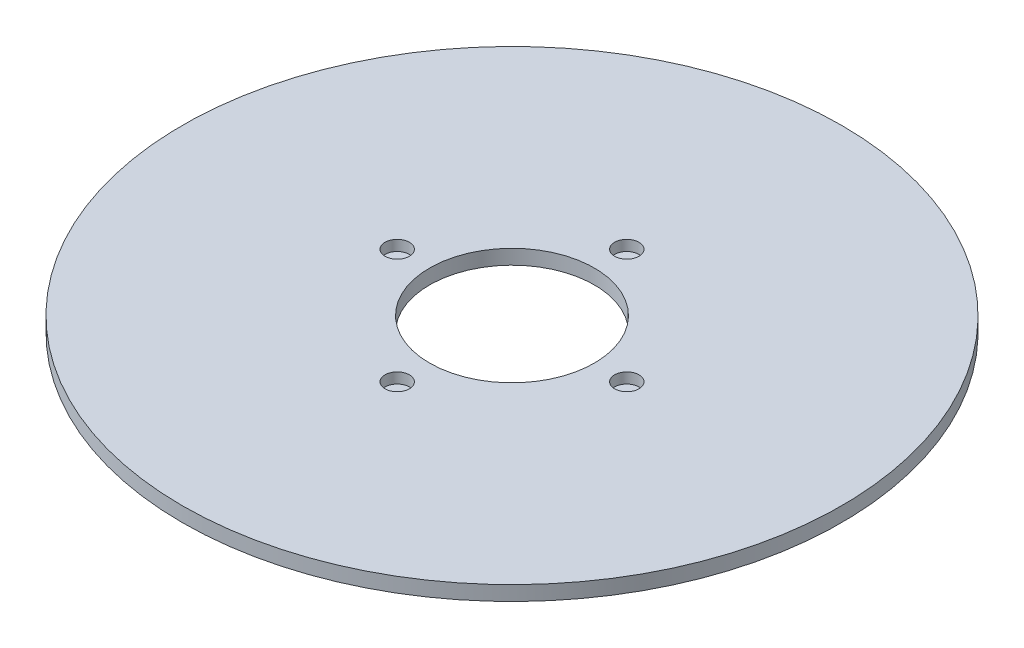
ISO-10303-21;
HEADER;
FILE_DESCRIPTION(('STEP AP214'),'2;1');
FILE_NAME('part.step','',(''),(''),'','','');
FILE_SCHEMA(('AUTOMOTIVE_DESIGN { 1 0 10303 214 1 1 1 1 }'));
ENDSEC;
DATA;
#1=APPLICATION_CONTEXT('core data for automotive mechanical design processes');
#2=APPLICATION_PROTOCOL_DEFINITION('international standard','automotive_design',2000,#1);
#3=PRODUCT_CONTEXT('',#1,'mechanical');
#4=PRODUCT('Part','Part','',(#3));
#5=PRODUCT_RELATED_PRODUCT_CATEGORY('part','',(#4));
#6=PRODUCT_DEFINITION_FORMATION('','',#4);
#7=PRODUCT_DEFINITION_CONTEXT('part definition',#1,'design');
#8=PRODUCT_DEFINITION('design','',#6,#7);
#9=PRODUCT_DEFINITION_SHAPE('','',#8);
#10=(LENGTH_UNIT() NAMED_UNIT(*) SI_UNIT(.MILLI.,.METRE.));
#11=(NAMED_UNIT(*) PLANE_ANGLE_UNIT() SI_UNIT($,.RADIAN.));
#12=(NAMED_UNIT(*) SI_UNIT($,.STERADIAN.) SOLID_ANGLE_UNIT());
#13=UNCERTAINTY_MEASURE_WITH_UNIT(LENGTH_MEASURE(1.E-05),#10,'distance_accuracy_value','');
#14=(GEOMETRIC_REPRESENTATION_CONTEXT(3) GLOBAL_UNCERTAINTY_ASSIGNED_CONTEXT((#13)) GLOBAL_UNIT_ASSIGNED_CONTEXT((#10,
#11,#12)) REPRESENTATION_CONTEXT('',''));
#15=CARTESIAN_POINT('',(0.,0.,0.));
#16=DIRECTION('',(0.,0.,1.));
#17=DIRECTION('',(1.,0.,0.));
#18=AXIS2_PLACEMENT_3D('',#15,#16,#17);
#19=CARTESIAN_POINT('',(0.,4.,0.));
#20=DIRECTION('',(0.,-1.,0.));
#21=DIRECTION('',(0.,0.,-1.));
#22=AXIS2_PLACEMENT_3D('',#19,#20,#21);
#23=CYLINDRICAL_SURFACE('',#22,90.);
#24=CARTESIAN_POINT('',(0.,4.,0.));
#25=DIRECTION('',(0.,1.,0.));
#26=DIRECTION('',(0.,0.,1.));
#27=AXIS2_PLACEMENT_3D('',#24,#25,#26);
#28=CIRCLE('',#27,90.);
#29=CARTESIAN_POINT('',(0.,4.,90.));
#30=VERTEX_POINT('',#29);
#31=EDGE_CURVE('E10',#30,#30,#28,.T.);
#32=ORIENTED_EDGE('',*,*,#31,.F.);
#33=EDGE_LOOP('',(#32));
#34=FACE_BOUND('',#33,.T.);
#35=CARTESIAN_POINT('',(0.,0.,0.));
#36=DIRECTION('',(0.,1.,0.));
#37=DIRECTION('',(0.,0.,1.));
#38=AXIS2_PLACEMENT_3D('',#35,#36,#37);
#39=CIRCLE('',#38,90.);
#40=CARTESIAN_POINT('',(0.,0.,90.));
#41=VERTEX_POINT('',#40);
#42=EDGE_CURVE('E37',#41,#41,#39,.T.);
#43=ORIENTED_EDGE('',*,*,#42,.T.);
#44=EDGE_LOOP('',(#43));
#45=FACE_BOUND('',#44,.T.);
#46=ADVANCED_FACE('F40',(#34,#45),#23,.T.);
#47=CARTESIAN_POINT('',(0.,4.,0.));
#48=DIRECTION('',(0.,1.,0.));
#49=DIRECTION('',(0.,0.,1.));
#50=AXIS2_PLACEMENT_3D('',#47,#48,#49);
#51=PLANE('',#50);
#52=CARTESIAN_POINT('',(1.09455664035941E-13,4.,31.3493481457953));
#53=DIRECTION('',(0.,1.,0.));
#54=DIRECTION('',(1.,0.,0.));
#55=AXIS2_PLACEMENT_3D('',#52,#53,#54);
#56=CIRCLE('',#55,3.32239042248186);
#57=CARTESIAN_POINT('',(3.32239042248197,4.,31.3493481457953));
#58=VERTEX_POINT('',#57);
#59=EDGE_CURVE('E71',#58,#58,#56,.T.);
#60=ORIENTED_EDGE('',*,*,#59,.F.);
#61=EDGE_LOOP('',(#60));
#62=FACE_BOUND('',#61,.T.);
#63=CARTESIAN_POINT('',(31.3493481457953,4.,0.));
#64=DIRECTION('',(0.,1.,0.));
#65=DIRECTION('',(0.,0.,-1.));
#66=AXIS2_PLACEMENT_3D('',#63,#64,#65);
#67=CIRCLE('',#66,3.32239042248186);
#68=CARTESIAN_POINT('',(31.3493481457953,4.,-3.32239042248186));
#69=VERTEX_POINT('',#68);
#70=EDGE_CURVE('E70',#69,#69,#67,.T.);
#71=ORIENTED_EDGE('',*,*,#70,.F.);
#72=EDGE_LOOP('',(#71));
#73=FACE_BOUND('',#72,.T.);
#74=CARTESIAN_POINT('',(-3.28366992107823E-13,4.,-31.3493481457953));
#75=DIRECTION('',(0.,1.,0.));
#76=DIRECTION('',(-1.,0.,0.));
#77=AXIS2_PLACEMENT_3D('',#74,#75,#76);
#78=CIRCLE('',#77,3.32239042248186);
#79=CARTESIAN_POINT('',(-3.32239042248219,4.,-31.3493481457953));
#80=VERTEX_POINT('',#79);
#81=EDGE_CURVE('E61',#80,#80,#78,.T.);
#82=ORIENTED_EDGE('',*,*,#81,.F.);
#83=EDGE_LOOP('',(#82));
#84=FACE_BOUND('',#83,.T.);
#85=CARTESIAN_POINT('',(-31.3493481457953,4.,0.));
#86=DIRECTION('',(0.,1.,0.));
#87=DIRECTION('',(0.,0.,1.));
#88=AXIS2_PLACEMENT_3D('',#85,#86,#87);
#89=CIRCLE('',#88,3.32239042248186);
#90=CARTESIAN_POINT('',(-31.3493481457953,4.,3.32239042248186));
#91=VERTEX_POINT('',#90);
#92=EDGE_CURVE('E54',#91,#91,#89,.T.);
#93=ORIENTED_EDGE('',*,*,#92,.F.);
#94=EDGE_LOOP('',(#93));
#95=FACE_BOUND('',#94,.T.);
#96=CARTESIAN_POINT('',(0.,4.,0.));
#97=DIRECTION('',(0.,1.,0.));
#98=DIRECTION('',(0.,0.,1.));
#99=AXIS2_PLACEMENT_3D('',#96,#97,#98);
#100=CIRCLE('',#99,22.5);
#101=CARTESIAN_POINT('',(0.,4.,22.5));
#102=VERTEX_POINT('',#101);
#103=EDGE_CURVE('E50',#102,#102,#100,.T.);
#104=ORIENTED_EDGE('',*,*,#103,.F.);
#105=EDGE_LOOP('',(#104));
#106=FACE_BOUND('',#105,.T.);
#107=ORIENTED_EDGE('',*,*,#31,.T.);
#108=EDGE_LOOP('',(#107));
#109=FACE_BOUND('',#108,.T.);
#110=ADVANCED_FACE('F86',(#62,#73,#84,#95,#106,#109),#51,.T.);
#111=CARTESIAN_POINT('',(0.,0.,0.));
#112=DIRECTION('',(0.,1.,0.));
#113=DIRECTION('',(0.,0.,1.));
#114=AXIS2_PLACEMENT_3D('',#111,#112,#113);
#115=PLANE('',#114);
#116=CARTESIAN_POINT('',(0.,0.,0.));
#117=DIRECTION('',(0.,1.,0.));
#118=DIRECTION('',(0.,0.,1.));
#119=AXIS2_PLACEMENT_3D('',#116,#117,#118);
#120=CIRCLE('',#119,22.5);
#121=CARTESIAN_POINT('',(0.,0.,22.5));
#122=VERTEX_POINT('',#121);
#123=EDGE_CURVE('E47',#122,#122,#120,.T.);
#124=ORIENTED_EDGE('',*,*,#123,.T.);
#125=EDGE_LOOP('',(#124));
#126=FACE_BOUND('',#125,.T.);
#127=ORIENTED_EDGE('',*,*,#42,.F.);
#128=EDGE_LOOP('',(#127));
#129=FACE_BOUND('',#128,.T.);
#130=ADVANCED_FACE('F93',(#126,#129),#115,.F.);
#131=CARTESIAN_POINT('',(0.,4.,0.));
#132=DIRECTION('',(0.,-1.,0.));
#133=DIRECTION('',(0.,0.,-1.));
#134=AXIS2_PLACEMENT_3D('',#131,#132,#133);
#135=CYLINDRICAL_SURFACE('',#134,22.5);
#136=ORIENTED_EDGE('',*,*,#103,.T.);
#137=EDGE_LOOP('',(#136));
#138=FACE_BOUND('',#137,.T.);
#139=ORIENTED_EDGE('',*,*,#123,.F.);
#140=EDGE_LOOP('',(#139));
#141=FACE_BOUND('',#140,.T.);
#142=ADVANCED_FACE('F101',(#138,#141),#135,.F.);
#143=CARTESIAN_POINT('',(-31.3493481457953,1.12181379695333,0.));
#144=DIRECTION('',(0.,1.,0.));
#145=DIRECTION('',(0.,0.,1.));
#146=AXIS2_PLACEMENT_3D('',#143,#144,#145);
#147=CYLINDRICAL_SURFACE('',#146,3.32239042248186);
#148=CARTESIAN_POINT('',(-31.3493481457953,1.12181379695333,0.));
#149=DIRECTION('',(0.,1.,0.));
#150=DIRECTION('',(0.,0.,1.));
#151=AXIS2_PLACEMENT_3D('',#148,#149,#150);
#152=CIRCLE('',#151,3.32239042248186);
#153=CARTESIAN_POINT('',(-31.3493481457953,1.12181379695333,3.32239042248186));
#154=VERTEX_POINT('',#153);
#155=EDGE_CURVE('E55',#154,#154,#152,.T.);
#156=ORIENTED_EDGE('',*,*,#155,.F.);
#157=EDGE_LOOP('',(#156));
#158=FACE_BOUND('',#157,.T.);
#159=ORIENTED_EDGE('',*,*,#92,.T.);
#160=EDGE_LOOP('',(#159));
#161=FACE_BOUND('',#160,.T.);
#162=ADVANCED_FACE('F102',(#158,#161),#147,.F.);
#163=CARTESIAN_POINT('',(-31.3493481457953,1.12181379695333,0.));
#164=DIRECTION('',(0.,1.,0.));
#165=DIRECTION('',(0.,0.,1.));
#166=AXIS2_PLACEMENT_3D('',#163,#164,#165);
#167=PLANE('',#166);
#168=ORIENTED_EDGE('',*,*,#155,.T.);
#169=EDGE_LOOP('',(#168));
#170=FACE_BOUND('',#169,.T.);
#171=ADVANCED_FACE('F133',(#170),#167,.T.);
#172=CARTESIAN_POINT('',(-3.28366992107823E-13,1.12181379695333,-31.3493481457953));
#173=DIRECTION('',(0.,1.,0.));
#174=DIRECTION('',(0.,0.,1.));
#175=AXIS2_PLACEMENT_3D('',#172,#173,#174);
#176=CYLINDRICAL_SURFACE('',#175,3.32239042248186);
#177=CARTESIAN_POINT('',(-3.28366992107823E-13,1.12181379695333,-31.3493481457953));
#178=DIRECTION('',(0.,1.,0.));
#179=DIRECTION('',(-1.,0.,0.));
#180=AXIS2_PLACEMENT_3D('',#177,#178,#179);
#181=CIRCLE('',#180,3.32239042248186);
#182=CARTESIAN_POINT('',(-3.32239042248219,1.12181379695333,-31.3493481457953));
#183=VERTEX_POINT('',#182);
#184=EDGE_CURVE('E63',#183,#183,#181,.T.);
#185=ORIENTED_EDGE('',*,*,#184,.F.);
#186=EDGE_LOOP('',(#185));
#187=FACE_BOUND('',#186,.T.);
#188=ORIENTED_EDGE('',*,*,#81,.T.);
#189=EDGE_LOOP('',(#188));
#190=FACE_BOUND('',#189,.T.);
#191=ADVANCED_FACE('F142',(#187,#190),#176,.F.);
#192=CARTESIAN_POINT('',(-3.28366992107823E-13,1.12181379695333,-31.3493481457953));
#193=DIRECTION('',(0.,1.,0.));
#194=DIRECTION('',(-1.,0.,0.));
#195=AXIS2_PLACEMENT_3D('',#192,#193,#194);
#196=PLANE('',#195);
#197=ORIENTED_EDGE('',*,*,#184,.T.);
#198=EDGE_LOOP('',(#197));
#199=FACE_BOUND('',#198,.T.);
#200=ADVANCED_FACE('F156',(#199),#196,.T.);
#201=CARTESIAN_POINT('',(31.3493481457953,1.12181379695333,0.));
#202=DIRECTION('',(0.,1.,0.));
#203=DIRECTION('',(0.,0.,1.));
#204=AXIS2_PLACEMENT_3D('',#201,#202,#203);
#205=CYLINDRICAL_SURFACE('',#204,3.32239042248186);
#206=CARTESIAN_POINT('',(31.3493481457953,1.12181379695333,0.));
#207=DIRECTION('',(0.,1.,0.));
#208=DIRECTION('',(0.,0.,-1.));
#209=AXIS2_PLACEMENT_3D('',#206,#207,#208);
#210=CIRCLE('',#209,3.32239042248186);
#211=CARTESIAN_POINT('',(31.3493481457953,1.12181379695333,-3.32239042248186));
#212=VERTEX_POINT('',#211);
#213=EDGE_CURVE('E69',#212,#212,#210,.T.);
#214=ORIENTED_EDGE('',*,*,#213,.F.);
#215=EDGE_LOOP('',(#214));
#216=FACE_BOUND('',#215,.T.);
#217=ORIENTED_EDGE('',*,*,#70,.T.);
#218=EDGE_LOOP('',(#217));
#219=FACE_BOUND('',#218,.T.);
#220=ADVANCED_FACE('F164',(#216,#219),#205,.F.);
#221=CARTESIAN_POINT('',(31.3493481457953,1.12181379695333,0.));
#222=DIRECTION('',(0.,1.,0.));
#223=DIRECTION('',(0.,0.,-1.));
#224=AXIS2_PLACEMENT_3D('',#221,#222,#223);
#225=PLANE('',#224);
#226=ORIENTED_EDGE('',*,*,#213,.T.);
#227=EDGE_LOOP('',(#226));
#228=FACE_BOUND('',#227,.T.);
#229=ADVANCED_FACE('F83',(#228),#225,.T.);
#230=CARTESIAN_POINT('',(1.09455664035941E-13,1.12181379695333,31.3493481457953));
#231=DIRECTION('',(0.,1.,0.));
#232=DIRECTION('',(0.,0.,1.));
#233=AXIS2_PLACEMENT_3D('',#230,#231,#232);
#234=CYLINDRICAL_SURFACE('',#233,3.32239042248186);
#235=CARTESIAN_POINT('',(1.09455664035941E-13,1.12181379695333,31.3493481457953));
#236=DIRECTION('',(0.,1.,0.));
#237=DIRECTION('',(1.,0.,0.));
#238=AXIS2_PLACEMENT_3D('',#235,#236,#237);
#239=CIRCLE('',#238,3.32239042248186);
#240=CARTESIAN_POINT('',(3.32239042248197,1.12181379695333,31.3493481457953));
#241=VERTEX_POINT('',#240);
#242=EDGE_CURVE('E59',#241,#241,#239,.T.);
#243=ORIENTED_EDGE('',*,*,#242,.F.);
#244=EDGE_LOOP('',(#243));
#245=FACE_BOUND('',#244,.T.);
#246=ORIENTED_EDGE('',*,*,#59,.T.);
#247=EDGE_LOOP('',(#246));
#248=FACE_BOUND('',#247,.T.);
#249=ADVANCED_FACE('F81',(#245,#248),#234,.F.);
#250=CARTESIAN_POINT('',(1.09455664035941E-13,1.12181379695333,31.3493481457953));
#251=DIRECTION('',(0.,1.,0.));
#252=DIRECTION('',(1.,0.,0.));
#253=AXIS2_PLACEMENT_3D('',#250,#251,#252);
#254=PLANE('',#253);
#255=ORIENTED_EDGE('',*,*,#242,.T.);
#256=EDGE_LOOP('',(#255));
#257=FACE_BOUND('',#256,.T.);
#258=ADVANCED_FACE('F78',(#257),#254,.T.);
#259=CLOSED_SHELL('',(#46,#110,#130,#142,#162,#171,#191,#200,#220,#229,#249,#258));
#260=MANIFOLD_SOLID_BREP('B2',#259);
#261=ADVANCED_BREP_SHAPE_REPRESENTATION('',(#18,#260),#14);
#262=SHAPE_DEFINITION_REPRESENTATION(#9,#261);
ENDSEC;
END-ISO-10303-21;
